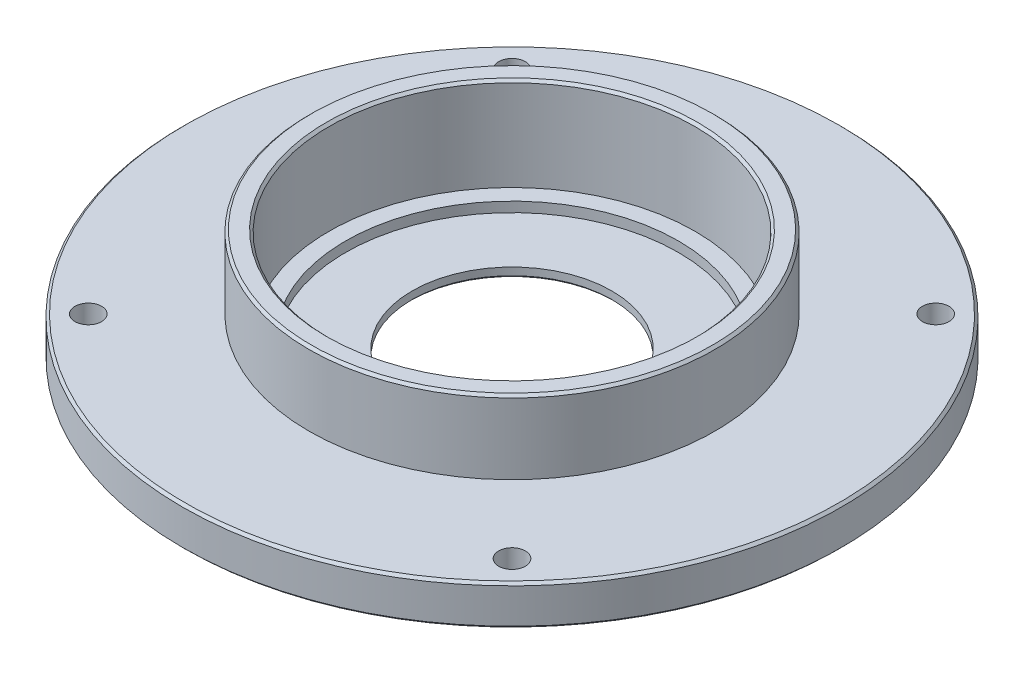
ISO-10303-21;
HEADER;
FILE_DESCRIPTION(('STEP AP214'),'2;1');
FILE_NAME('part.step','',(''),(''),'','','');
FILE_SCHEMA(('AUTOMOTIVE_DESIGN { 1 0 10303 214 1 1 1 1 }'));
ENDSEC;
DATA;
#1=APPLICATION_CONTEXT('core data for automotive mechanical design processes');
#2=APPLICATION_PROTOCOL_DEFINITION('international standard','automotive_design',2000,#1);
#3=PRODUCT_CONTEXT('',#1,'mechanical');
#4=PRODUCT('Part','Part','',(#3));
#5=PRODUCT_RELATED_PRODUCT_CATEGORY('part','',(#4));
#6=PRODUCT_DEFINITION_FORMATION('','',#4);
#7=PRODUCT_DEFINITION_CONTEXT('part definition',#1,'design');
#8=PRODUCT_DEFINITION('design','',#6,#7);
#9=PRODUCT_DEFINITION_SHAPE('','',#8);
#10=(LENGTH_UNIT() NAMED_UNIT(*) SI_UNIT(.MILLI.,.METRE.));
#11=(NAMED_UNIT(*) PLANE_ANGLE_UNIT() SI_UNIT($,.RADIAN.));
#12=(NAMED_UNIT(*) SI_UNIT($,.STERADIAN.) SOLID_ANGLE_UNIT());
#13=UNCERTAINTY_MEASURE_WITH_UNIT(LENGTH_MEASURE(1.E-05),#10,'distance_accuracy_value','');
#14=(GEOMETRIC_REPRESENTATION_CONTEXT(3) GLOBAL_UNCERTAINTY_ASSIGNED_CONTEXT((#13)) GLOBAL_UNIT_ASSIGNED_CONTEXT((#10,
#11,#12)) REPRESENTATION_CONTEXT('',''));
#15=CARTESIAN_POINT('',(0.,0.,0.));
#16=DIRECTION('',(0.,0.,1.));
#17=DIRECTION('',(1.,0.,0.));
#18=AXIS2_PLACEMENT_3D('',#15,#16,#17);
#19=CARTESIAN_POINT('',(-50.,6.,0.));
#20=DIRECTION('',(0.,-1.,0.));
#21=DIRECTION('',(0.,0.,-1.));
#22=AXIS2_PLACEMENT_3D('',#19,#20,#21);
#23=PLANE('',#22);
#24=CARTESIAN_POINT('',(0.,6.,0.));
#25=DIRECTION('',(0.,-1.,0.));
#26=DIRECTION('',(0.,0.,-1.));
#27=AXIS2_PLACEMENT_3D('',#24,#25,#26);
#28=CIRCLE('',#27,55.);
#29=CARTESIAN_POINT('',(0.,6.,-55.));
#30=VERTEX_POINT('',#29);
#31=EDGE_CURVE('E82',#30,#30,#28,.T.);
#32=ORIENTED_EDGE('',*,*,#31,.F.);
#33=EDGE_LOOP('',(#32));
#34=FACE_BOUND('',#33,.T.);
#35=CARTESIAN_POINT('',(0.,6.,0.));
#36=DIRECTION('',(0.,-1.,0.));
#37=DIRECTION('',(0.,0.,-1.));
#38=AXIS2_PLACEMENT_3D('',#35,#36,#37);
#39=CIRCLE('',#38,50.);
#40=CARTESIAN_POINT('',(0.,6.,-50.));
#41=VERTEX_POINT('',#40);
#42=EDGE_CURVE('E70',#41,#41,#39,.T.);
#43=ORIENTED_EDGE('',*,*,#42,.T.);
#44=EDGE_LOOP('',(#43));
#45=FACE_BOUND('',#44,.T.);
#46=ADVANCED_FACE('F32',(#34,#45),#23,.F.);
#47=CARTESIAN_POINT('',(0.,0.,0.));
#48=DIRECTION('',(0.,-1.,0.));
#49=DIRECTION('',(0.,0.,-1.));
#50=AXIS2_PLACEMENT_3D('',#47,#48,#49);
#51=CYLINDRICAL_SURFACE('',#50,50.);
#52=ORIENTED_EDGE('',*,*,#42,.F.);
#53=EDGE_LOOP('',(#52));
#54=FACE_BOUND('',#53,.T.);
#55=CARTESIAN_POINT('',(0.,3.,0.));
#56=DIRECTION('',(0.,-1.,0.));
#57=DIRECTION('',(0.,0.,-1.));
#58=AXIS2_PLACEMENT_3D('',#55,#56,#57);
#59=CIRCLE('',#58,50.);
#60=CARTESIAN_POINT('',(0.,3.,-50.));
#61=VERTEX_POINT('',#60);
#62=EDGE_CURVE('E73',#61,#61,#59,.T.);
#63=ORIENTED_EDGE('',*,*,#62,.T.);
#64=EDGE_LOOP('',(#63));
#65=FACE_BOUND('',#64,.T.);
#66=ADVANCED_FACE('F134',(#54,#65),#51,.F.);
#67=CARTESIAN_POINT('',(-50.,3.,0.));
#68=DIRECTION('',(0.,-1.,0.));
#69=DIRECTION('',(0.,0.,-1.));
#70=AXIS2_PLACEMENT_3D('',#67,#68,#69);
#71=PLANE('',#70);
#72=ORIENTED_EDGE('',*,*,#62,.F.);
#73=EDGE_LOOP('',(#72));
#74=FACE_BOUND('',#73,.T.);
#75=CARTESIAN_POINT('',(0.,3.,0.));
#76=DIRECTION('',(0.,-1.,0.));
#77=DIRECTION('',(0.,0.,-1.));
#78=AXIS2_PLACEMENT_3D('',#75,#76,#77);
#79=CIRCLE('',#78,30.);
#80=CARTESIAN_POINT('',(0.,3.,-30.));
#81=VERTEX_POINT('',#80);
#82=EDGE_CURVE('E76',#81,#81,#79,.T.);
#83=ORIENTED_EDGE('',*,*,#82,.T.);
#84=EDGE_LOOP('',(#83));
#85=FACE_BOUND('',#84,.T.);
#86=ADVANCED_FACE('F140',(#74,#85),#71,.F.);
#87=CARTESIAN_POINT('',(0.,0.,0.));
#88=DIRECTION('',(0.,-1.,0.));
#89=DIRECTION('',(0.,0.,-1.));
#90=AXIS2_PLACEMENT_3D('',#87,#88,#89);
#91=CYLINDRICAL_SURFACE('',#90,30.);
#92=CARTESIAN_POINT('',(0.,0.749999999999965,0.));
#93=DIRECTION('',(0.,1.,0.));
#94=DIRECTION('',(0.,0.,1.));
#95=AXIS2_PLACEMENT_3D('',#92,#93,#94);
#96=CIRCLE('',#95,30.);
#97=CARTESIAN_POINT('',(0.,0.749999999999965,30.));
#98=VERTEX_POINT('',#97);
#99=EDGE_CURVE('E67',#98,#98,#96,.F.);
#100=ORIENTED_EDGE('',*,*,#99,.T.);
#101=EDGE_LOOP('',(#100));
#102=FACE_BOUND('',#101,.T.);
#103=ORIENTED_EDGE('',*,*,#82,.F.);
#104=EDGE_LOOP('',(#103));
#105=FACE_BOUND('',#104,.T.);
#106=ADVANCED_FACE('F243',(#102,#105),#91,.F.);
#107=CARTESIAN_POINT('',(-30.,0.,0.));
#108=DIRECTION('',(0.,1.,0.));
#109=DIRECTION('',(0.,0.,1.));
#110=AXIS2_PLACEMENT_3D('',#107,#108,#109);
#111=PLANE('',#110);
#112=CARTESIAN_POINT('',(0.,0.,0.));
#113=DIRECTION('',(0.,1.,0.));
#114=DIRECTION('',(0.,0.,1.));
#115=AXIS2_PLACEMENT_3D('',#112,#113,#114);
#116=CIRCLE('',#115,30.75);
#117=CARTESIAN_POINT('',(0.,0.,30.75));
#118=VERTEX_POINT('',#117);
#119=EDGE_CURVE('E61',#118,#118,#116,.T.);
#120=ORIENTED_EDGE('',*,*,#119,.T.);
#121=EDGE_LOOP('',(#120));
#122=FACE_BOUND('',#121,.T.);
#123=CARTESIAN_POINT('',(0.,0.,0.));
#124=DIRECTION('',(0.,1.,0.));
#125=DIRECTION('',(0.,0.,1.));
#126=AXIS2_PLACEMENT_3D('',#123,#124,#125);
#127=CIRCLE('',#126,98.2500000000001);
#128=CARTESIAN_POINT('',(0.,0.,98.2500000000001));
#129=VERTEX_POINT('',#128);
#130=EDGE_CURVE('E64',#129,#129,#127,.F.);
#131=ORIENTED_EDGE('',*,*,#130,.T.);
#132=EDGE_LOOP('',(#131));
#133=FACE_BOUND('',#132,.T.);
#134=CARTESIAN_POINT('',(-63.6396103067893,0.,63.6396103067893));
#135=DIRECTION('',(0.,1.,0.));
#136=DIRECTION('',(0.,0.,1.));
#137=AXIS2_PLACEMENT_3D('',#134,#135,#136);
#138=CIRCLE('',#137,4.00000000000001);
#139=CARTESIAN_POINT('',(-63.6396103067893,0.,67.6396103067893));
#140=VERTEX_POINT('',#139);
#141=EDGE_CURVE('E92',#140,#140,#138,.F.);
#142=ORIENTED_EDGE('',*,*,#141,.F.);
#143=EDGE_LOOP('',(#142));
#144=FACE_BOUND('',#143,.T.);
#145=CARTESIAN_POINT('',(63.6396103067893,0.,63.6396103067893));
#146=DIRECTION('',(0.,1.,0.));
#147=DIRECTION('',(0.,0.,1.));
#148=AXIS2_PLACEMENT_3D('',#145,#146,#147);
#149=CIRCLE('',#148,4.00000000000002);
#150=CARTESIAN_POINT('',(63.6396103067893,0.,67.6396103067893));
#151=VERTEX_POINT('',#150);
#152=EDGE_CURVE('E99',#151,#151,#149,.F.);
#153=ORIENTED_EDGE('',*,*,#152,.F.);
#154=EDGE_LOOP('',(#153));
#155=FACE_BOUND('',#154,.T.);
#156=CARTESIAN_POINT('',(63.6396103067893,0.,-63.6396103067893));
#157=DIRECTION('',(0.,1.,0.));
#158=DIRECTION('',(0.,0.,1.));
#159=AXIS2_PLACEMENT_3D('',#156,#157,#158);
#160=CIRCLE('',#159,4.00000000000002);
#161=CARTESIAN_POINT('',(63.6396103067893,0.,-59.6396103067893));
#162=VERTEX_POINT('',#161);
#163=EDGE_CURVE('E91',#162,#162,#160,.F.);
#164=ORIENTED_EDGE('',*,*,#163,.F.);
#165=EDGE_LOOP('',(#164));
#166=FACE_BOUND('',#165,.T.);
#167=CARTESIAN_POINT('',(-63.6396103067893,0.,-63.6396103067893));
#168=DIRECTION('',(0.,1.,0.));
#169=DIRECTION('',(0.,0.,1.));
#170=AXIS2_PLACEMENT_3D('',#167,#168,#169);
#171=CIRCLE('',#170,4.00000000000001);
#172=CARTESIAN_POINT('',(-63.6396103067893,0.,-59.6396103067893));
#173=VERTEX_POINT('',#172);
#174=EDGE_CURVE('E85',#173,#173,#171,.F.);
#175=ORIENTED_EDGE('',*,*,#174,.F.);
#176=EDGE_LOOP('',(#175));
#177=FACE_BOUND('',#176,.T.);
#178=ADVANCED_FACE('F233',(#122,#133,#144,#155,#166,#177),#111,.F.);
#179=CARTESIAN_POINT('',(0.,0.,0.));
#180=DIRECTION('',(0.,-1.,0.));
#181=DIRECTION('',(0.,0.,-1.));
#182=AXIS2_PLACEMENT_3D('',#179,#180,#181);
#183=CYLINDRICAL_SURFACE('',#182,99.);
#184=CARTESIAN_POINT('',(0.,0.749999999999899,0.));
#185=DIRECTION('',(0.,1.,0.));
#186=DIRECTION('',(0.,0.,1.));
#187=AXIS2_PLACEMENT_3D('',#184,#185,#186);
#188=CIRCLE('',#187,99.);
#189=CARTESIAN_POINT('',(0.,0.749999999999899,99.));
#190=VERTEX_POINT('',#189);
#191=EDGE_CURVE('E55',#190,#190,#188,.T.);
#192=ORIENTED_EDGE('',*,*,#191,.T.);
#193=EDGE_LOOP('',(#192));
#194=FACE_BOUND('',#193,.T.);
#195=CARTESIAN_POINT('',(0.,11.2499999999999,0.));
#196=DIRECTION('',(0.,-1.,0.));
#197=DIRECTION('',(0.,0.,-1.));
#198=AXIS2_PLACEMENT_3D('',#195,#196,#197);
#199=CIRCLE('',#198,99.);
#200=CARTESIAN_POINT('',(0.,11.2499999999999,-99.));
#201=VERTEX_POINT('',#200);
#202=EDGE_CURVE('E58',#201,#201,#199,.T.);
#203=ORIENTED_EDGE('',*,*,#202,.T.);
#204=EDGE_LOOP('',(#203));
#205=FACE_BOUND('',#204,.T.);
#206=ADVANCED_FACE('F117',(#194,#205),#183,.T.);
#207=CARTESIAN_POINT('',(-61.,11.9999999999999,0.));
#208=DIRECTION('',(0.,-1.,0.));
#209=DIRECTION('',(0.,0.,-1.));
#210=AXIS2_PLACEMENT_3D('',#207,#208,#209);
#211=PLANE('',#210);
#212=CARTESIAN_POINT('',(0.,11.9999999999999,0.));
#213=DIRECTION('',(0.,-1.,0.));
#214=DIRECTION('',(0.,0.,-1.));
#215=AXIS2_PLACEMENT_3D('',#212,#213,#214);
#216=CIRCLE('',#215,98.25);
#217=CARTESIAN_POINT('',(0.,11.9999999999999,-98.25));
#218=VERTEX_POINT('',#217);
#219=EDGE_CURVE('E52',#218,#218,#216,.F.);
#220=ORIENTED_EDGE('',*,*,#219,.T.);
#221=EDGE_LOOP('',(#220));
#222=FACE_BOUND('',#221,.T.);
#223=CARTESIAN_POINT('',(-63.6396103067893,11.9999999999999,63.6396103067893));
#224=DIRECTION('',(0.,1.,0.));
#225=DIRECTION('',(0.,0.,1.));
#226=AXIS2_PLACEMENT_3D('',#223,#224,#225);
#227=CIRCLE('',#226,4.00000000000001);
#228=CARTESIAN_POINT('',(-63.6396103067893,11.9999999999999,67.6396103067893));
#229=VERTEX_POINT('',#228);
#230=EDGE_CURVE('E96',#229,#229,#227,.T.);
#231=ORIENTED_EDGE('',*,*,#230,.F.);
#232=EDGE_LOOP('',(#231));
#233=FACE_BOUND('',#232,.T.);
#234=CARTESIAN_POINT('',(63.6396103067893,11.9999999999999,63.6396103067893));
#235=DIRECTION('',(0.,1.,0.));
#236=DIRECTION('',(0.,0.,1.));
#237=AXIS2_PLACEMENT_3D('',#234,#235,#236);
#238=CIRCLE('',#237,4.00000000000002);
#239=CARTESIAN_POINT('',(63.6396103067893,11.9999999999999,67.6396103067893));
#240=VERTEX_POINT('',#239);
#241=EDGE_CURVE('E95',#240,#240,#238,.T.);
#242=ORIENTED_EDGE('',*,*,#241,.F.);
#243=EDGE_LOOP('',(#242));
#244=FACE_BOUND('',#243,.T.);
#245=CARTESIAN_POINT('',(63.6396103067893,11.9999999999999,-63.6396103067893));
#246=DIRECTION('',(0.,1.,0.));
#247=DIRECTION('',(0.,0.,1.));
#248=AXIS2_PLACEMENT_3D('',#245,#246,#247);
#249=CIRCLE('',#248,4.00000000000002);
#250=CARTESIAN_POINT('',(63.6396103067893,11.9999999999999,-59.6396103067893));
#251=VERTEX_POINT('',#250);
#252=EDGE_CURVE('E102',#251,#251,#249,.T.);
#253=ORIENTED_EDGE('',*,*,#252,.F.);
#254=EDGE_LOOP('',(#253));
#255=FACE_BOUND('',#254,.T.);
#256=CARTESIAN_POINT('',(-63.6396103067893,11.9999999999999,-63.6396103067893));
#257=DIRECTION('',(0.,1.,0.));
#258=DIRECTION('',(0.,0.,1.));
#259=AXIS2_PLACEMENT_3D('',#256,#257,#258);
#260=CIRCLE('',#259,4.00000000000001);
#261=CARTESIAN_POINT('',(-63.6396103067893,11.9999999999999,-59.6396103067893));
#262=VERTEX_POINT('',#261);
#263=EDGE_CURVE('E88',#262,#262,#260,.T.);
#264=ORIENTED_EDGE('',*,*,#263,.F.);
#265=EDGE_LOOP('',(#264));
#266=FACE_BOUND('',#265,.T.);
#267=CARTESIAN_POINT('',(0.,11.9999999999999,0.));
#268=DIRECTION('',(0.,-1.,0.));
#269=DIRECTION('',(0.,0.,-1.));
#270=AXIS2_PLACEMENT_3D('',#267,#268,#269);
#271=CIRCLE('',#270,61.);
#272=CARTESIAN_POINT('',(0.,11.9999999999999,-61.));
#273=VERTEX_POINT('',#272);
#274=EDGE_CURVE('E79',#273,#273,#271,.T.);
#275=ORIENTED_EDGE('',*,*,#274,.T.);
#276=EDGE_LOOP('',(#275));
#277=FACE_BOUND('',#276,.T.);
#278=ADVANCED_FACE('F113',(#222,#233,#244,#255,#266,#277),#211,.F.);
#279=CARTESIAN_POINT('',(0.,0.,0.));
#280=DIRECTION('',(0.,-1.,0.));
#281=DIRECTION('',(0.,0.,-1.));
#282=AXIS2_PLACEMENT_3D('',#279,#280,#281);
#283=CYLINDRICAL_SURFACE('',#282,61.);
#284=CARTESIAN_POINT('',(0.,33.25,0.));
#285=DIRECTION('',(0.,-1.,0.));
#286=DIRECTION('',(0.,0.,-1.));
#287=AXIS2_PLACEMENT_3D('',#284,#285,#286);
#288=CIRCLE('',#287,61.);
#289=CARTESIAN_POINT('',(0.,33.25,-61.));
#290=VERTEX_POINT('',#289);
#291=EDGE_CURVE('E10',#290,#290,#288,.T.);
#292=ORIENTED_EDGE('',*,*,#291,.T.);
#293=EDGE_LOOP('',(#292));
#294=FACE_BOUND('',#293,.T.);
#295=ORIENTED_EDGE('',*,*,#274,.F.);
#296=EDGE_LOOP('',(#295));
#297=FACE_BOUND('',#296,.T.);
#298=ADVANCED_FACE('F116',(#294,#297),#283,.T.);
#299=CARTESIAN_POINT('',(-55.,34.,0.));
#300=DIRECTION('',(0.,-1.,0.));
#301=DIRECTION('',(0.,0.,-1.));
#302=AXIS2_PLACEMENT_3D('',#299,#300,#301);
#303=PLANE('',#302);
#304=CARTESIAN_POINT('',(0.,34.,0.));
#305=DIRECTION('',(0.,-1.,0.));
#306=DIRECTION('',(0.,0.,-1.));
#307=AXIS2_PLACEMENT_3D('',#304,#305,#306);
#308=CIRCLE('',#307,55.75);
#309=CARTESIAN_POINT('',(0.,34.,-55.75));
#310=VERTEX_POINT('',#309);
#311=EDGE_CURVE('E43',#310,#310,#308,.T.);
#312=ORIENTED_EDGE('',*,*,#311,.T.);
#313=EDGE_LOOP('',(#312));
#314=FACE_BOUND('',#313,.T.);
#315=CARTESIAN_POINT('',(0.,34.,0.));
#316=DIRECTION('',(0.,-1.,0.));
#317=DIRECTION('',(0.,0.,-1.));
#318=AXIS2_PLACEMENT_3D('',#315,#316,#317);
#319=CIRCLE('',#318,60.25);
#320=CARTESIAN_POINT('',(0.,34.,-60.25));
#321=VERTEX_POINT('',#320);
#322=EDGE_CURVE('E47',#321,#321,#319,.F.);
#323=ORIENTED_EDGE('',*,*,#322,.T.);
#324=EDGE_LOOP('',(#323));
#325=FACE_BOUND('',#324,.T.);
#326=ADVANCED_FACE('F125',(#314,#325),#303,.F.);
#327=CARTESIAN_POINT('',(0.,0.,0.));
#328=DIRECTION('',(0.,-1.,0.));
#329=DIRECTION('',(0.,0.,-1.));
#330=AXIS2_PLACEMENT_3D('',#327,#328,#329);
#331=CYLINDRICAL_SURFACE('',#330,55.);
#332=CARTESIAN_POINT('',(0.,33.25,0.));
#333=DIRECTION('',(0.,-1.,0.));
#334=DIRECTION('',(0.,0.,-1.));
#335=AXIS2_PLACEMENT_3D('',#332,#333,#334);
#336=CIRCLE('',#335,55.);
#337=CARTESIAN_POINT('',(0.,33.25,-55.));
#338=VERTEX_POINT('',#337);
#339=EDGE_CURVE('E39',#338,#338,#336,.F.);
#340=ORIENTED_EDGE('',*,*,#339,.T.);
#341=EDGE_LOOP('',(#340));
#342=FACE_BOUND('',#341,.T.);
#343=ORIENTED_EDGE('',*,*,#31,.T.);
#344=EDGE_LOOP('',(#343));
#345=FACE_BOUND('',#344,.T.);
#346=ADVANCED_FACE('F130',(#342,#345),#331,.F.);
#347=CARTESIAN_POINT('',(-63.6396103067893,-0.00100000000000794,-63.6396103067893));
#348=DIRECTION('',(0.,1.,0.));
#349=DIRECTION('',(0.,0.,1.));
#350=AXIS2_PLACEMENT_3D('',#347,#348,#349);
#351=CYLINDRICAL_SURFACE('',#350,4.00000000000001);
#352=ORIENTED_EDGE('',*,*,#263,.T.);
#353=EDGE_LOOP('',(#352));
#354=FACE_BOUND('',#353,.T.);
#355=ORIENTED_EDGE('',*,*,#174,.T.);
#356=EDGE_LOOP('',(#355));
#357=FACE_BOUND('',#356,.T.);
#358=ADVANCED_FACE('F206',(#354,#357),#351,.F.);
#359=CARTESIAN_POINT('',(63.6396103067893,-0.00100000000000794,-63.6396103067893));
#360=DIRECTION('',(0.,1.,0.));
#361=DIRECTION('',(0.,0.,1.));
#362=AXIS2_PLACEMENT_3D('',#359,#360,#361);
#363=CYLINDRICAL_SURFACE('',#362,4.00000000000002);
#364=ORIENTED_EDGE('',*,*,#252,.T.);
#365=EDGE_LOOP('',(#364));
#366=FACE_BOUND('',#365,.T.);
#367=ORIENTED_EDGE('',*,*,#163,.T.);
#368=EDGE_LOOP('',(#367));
#369=FACE_BOUND('',#368,.T.);
#370=ADVANCED_FACE('F110',(#366,#369),#363,.F.);
#371=CARTESIAN_POINT('',(63.6396103067893,-0.00100000000000794,63.6396103067893));
#372=DIRECTION('',(0.,1.,0.));
#373=DIRECTION('',(0.,0.,1.));
#374=AXIS2_PLACEMENT_3D('',#371,#372,#373);
#375=CYLINDRICAL_SURFACE('',#374,4.00000000000002);
#376=ORIENTED_EDGE('',*,*,#241,.T.);
#377=EDGE_LOOP('',(#376));
#378=FACE_BOUND('',#377,.T.);
#379=ORIENTED_EDGE('',*,*,#152,.T.);
#380=EDGE_LOOP('',(#379));
#381=FACE_BOUND('',#380,.T.);
#382=ADVANCED_FACE('F262',(#378,#381),#375,.F.);
#383=CARTESIAN_POINT('',(-63.6396103067893,-0.00100000000000794,63.6396103067893));
#384=DIRECTION('',(0.,1.,0.));
#385=DIRECTION('',(0.,0.,1.));
#386=AXIS2_PLACEMENT_3D('',#383,#384,#385);
#387=CYLINDRICAL_SURFACE('',#386,4.00000000000001);
#388=ORIENTED_EDGE('',*,*,#230,.T.);
#389=EDGE_LOOP('',(#388));
#390=FACE_BOUND('',#389,.T.);
#391=ORIENTED_EDGE('',*,*,#141,.T.);
#392=EDGE_LOOP('',(#391));
#393=FACE_BOUND('',#392,.T.);
#394=ADVANCED_FACE('F151',(#390,#393),#387,.F.);
#395=CARTESIAN_POINT('',(0.,0.749999999999965,0.));
#396=DIRECTION('',(0.,-1.,0.));
#397=DIRECTION('',(0.,0.,-1.));
#398=AXIS2_PLACEMENT_3D('',#395,#396,#397);
#399=CONICAL_SURFACE('',#398,30.,0.785398163397453);
#400=ORIENTED_EDGE('',*,*,#119,.F.);
#401=EDGE_LOOP('',(#400));
#402=FACE_BOUND('',#401,.T.);
#403=ORIENTED_EDGE('',*,*,#99,.F.);
#404=EDGE_LOOP('',(#403));
#405=FACE_BOUND('',#404,.T.);
#406=ADVANCED_FACE('F147',(#402,#405),#399,.F.);
#407=CARTESIAN_POINT('',(0.,0.,0.));
#408=DIRECTION('',(0.,1.,0.));
#409=DIRECTION('',(0.,0.,1.));
#410=AXIS2_PLACEMENT_3D('',#407,#408,#409);
#411=CONICAL_SURFACE('',#410,98.2500000000001,0.785398163397476);
#412=ORIENTED_EDGE('',*,*,#191,.F.);
#413=EDGE_LOOP('',(#412));
#414=FACE_BOUND('',#413,.T.);
#415=ORIENTED_EDGE('',*,*,#130,.F.);
#416=EDGE_LOOP('',(#415));
#417=FACE_BOUND('',#416,.T.);
#418=ADVANCED_FACE('F150',(#414,#417),#411,.T.);
#419=CARTESIAN_POINT('',(0.,11.2499999999999,0.));
#420=DIRECTION('',(0.,-1.,0.));
#421=DIRECTION('',(0.,0.,-1.));
#422=AXIS2_PLACEMENT_3D('',#419,#420,#421);
#423=CONICAL_SURFACE('',#422,99.,0.785398163397467);
#424=ORIENTED_EDGE('',*,*,#219,.F.);
#425=EDGE_LOOP('',(#424));
#426=FACE_BOUND('',#425,.T.);
#427=ORIENTED_EDGE('',*,*,#202,.F.);
#428=EDGE_LOOP('',(#427));
#429=FACE_BOUND('',#428,.T.);
#430=ADVANCED_FACE('F155',(#426,#429),#423,.T.);
#431=CARTESIAN_POINT('',(0.,34.,0.));
#432=DIRECTION('',(0.,1.,0.));
#433=DIRECTION('',(0.,0.,1.));
#434=AXIS2_PLACEMENT_3D('',#431,#432,#433);
#435=CONICAL_SURFACE('',#434,55.75,0.785398163397453);
#436=ORIENTED_EDGE('',*,*,#339,.F.);
#437=EDGE_LOOP('',(#436));
#438=FACE_BOUND('',#437,.T.);
#439=ORIENTED_EDGE('',*,*,#311,.F.);
#440=EDGE_LOOP('',(#439));
#441=FACE_BOUND('',#440,.T.);
#442=ADVANCED_FACE('F158',(#438,#441),#435,.F.);
#443=CARTESIAN_POINT('',(0.,33.25,0.));
#444=DIRECTION('',(0.,-1.,0.));
#445=DIRECTION('',(0.,0.,-1.));
#446=AXIS2_PLACEMENT_3D('',#443,#444,#445);
#447=CONICAL_SURFACE('',#446,61.,0.785398163397462);
#448=ORIENTED_EDGE('',*,*,#322,.F.);
#449=EDGE_LOOP('',(#448));
#450=FACE_BOUND('',#449,.T.);
#451=ORIENTED_EDGE('',*,*,#291,.F.);
#452=EDGE_LOOP('',(#451));
#453=FACE_BOUND('',#452,.T.);
#454=ADVANCED_FACE('F34',(#450,#453),#447,.T.);
#455=CLOSED_SHELL('',(#46,#66,#86,#106,#178,#206,#278,#298,#326,#346,#358,#370,#382,#394,#406,
#418,#430,#442,#454));
#456=MANIFOLD_SOLID_BREP('B2',#455);
#457=ADVANCED_BREP_SHAPE_REPRESENTATION('',(#18,#456),#14);
#458=SHAPE_DEFINITION_REPRESENTATION(#9,#457);
ENDSEC;
END-ISO-10303-21;
